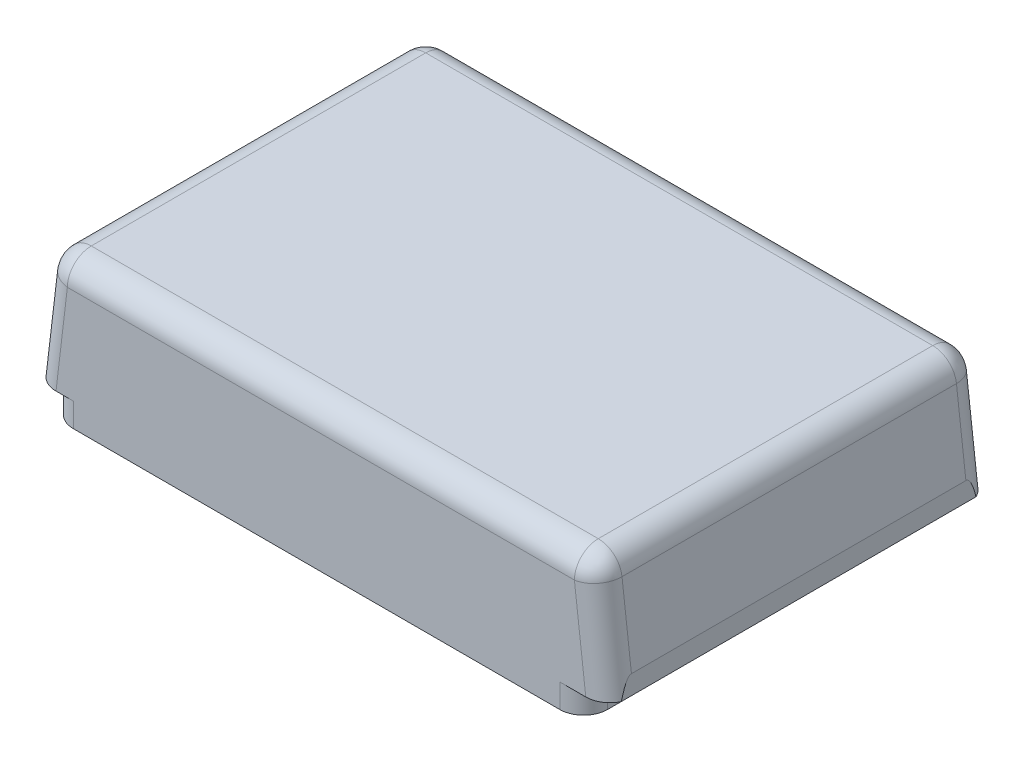
ISO-10303-21;
HEADER;
FILE_DESCRIPTION(('STEP AP214'),'2;1');
FILE_NAME('part.step','',(''),(''),'','','');
FILE_SCHEMA(('AUTOMOTIVE_DESIGN { 1 0 10303 214 1 1 1 1 }'));
ENDSEC;
DATA;
#1=APPLICATION_CONTEXT('core data for automotive mechanical design processes');
#2=APPLICATION_PROTOCOL_DEFINITION('international standard','automotive_design',2000,#1);
#3=PRODUCT_CONTEXT('',#1,'mechanical');
#4=PRODUCT('Part','Part','',(#3));
#5=PRODUCT_RELATED_PRODUCT_CATEGORY('part','',(#4));
#6=PRODUCT_DEFINITION_FORMATION('','',#4);
#7=PRODUCT_DEFINITION_CONTEXT('part definition',#1,'design');
#8=PRODUCT_DEFINITION('design','',#6,#7);
#9=PRODUCT_DEFINITION_SHAPE('','',#8);
#10=(LENGTH_UNIT() NAMED_UNIT(*) SI_UNIT(.MILLI.,.METRE.));
#11=(NAMED_UNIT(*) PLANE_ANGLE_UNIT() SI_UNIT($,.RADIAN.));
#12=(NAMED_UNIT(*) SI_UNIT($,.STERADIAN.) SOLID_ANGLE_UNIT());
#13=UNCERTAINTY_MEASURE_WITH_UNIT(LENGTH_MEASURE(1.E-05),#10,'distance_accuracy_value','');
#14=(GEOMETRIC_REPRESENTATION_CONTEXT(3) GLOBAL_UNCERTAINTY_ASSIGNED_CONTEXT((#13)) GLOBAL_UNIT_ASSIGNED_CONTEXT((#10,
#11,#12)) REPRESENTATION_CONTEXT('',''));
#15=CARTESIAN_POINT('',(0.,0.,0.));
#16=DIRECTION('',(0.,0.,1.));
#17=DIRECTION('',(1.,0.,0.));
#18=AXIS2_PLACEMENT_3D('',#15,#16,#17);
#19=CARTESIAN_POINT('',(-120.,0.,160.));
#20=DIRECTION('',(1.,0.,0.));
#21=DIRECTION('',(0.,0.,-1.));
#22=AXIS2_PLACEMENT_3D('',#19,#20,#21);
#23=PLANE('',#22);
#24=DIRECTION('',(0.,0.,-1.));
#25=VECTOR('',#24,1.);
#26=CARTESIAN_POINT('',(-120.,-8.,160.));
#27=LINE('',#26,#25);
#28=CARTESIAN_POINT('',(-120.,-8.,154.244962659163));
#29=VERTEX_POINT('',#28);
#30=CARTESIAN_POINT('',(-120.,-8.,5.7550373408366));
#31=VERTEX_POINT('',#30);
#32=EDGE_CURVE('E201',#29,#31,#27,.T.);
#33=ORIENTED_EDGE('',*,*,#32,.F.);
#34=CARTESIAN_POINT('',(-120.,-84.5931439302263,150.));
#35=DIRECTION('',(1.,0.,0.));
#36=DIRECTION('',(0.,1.,0.));
#37=AXIS2_PLACEMENT_3D('',#34,#35,#36);
#38=ELLIPSE('',#37,84.5931439302263,10.);
#39=CARTESIAN_POINT('',(-120.,0.,150.));
#40=VERTEX_POINT('',#39);
#41=EDGE_CURVE('E220',#29,#40,#38,.F.);
#42=ORIENTED_EDGE('',*,*,#41,.T.);
#43=DIRECTION('',(0.,0.,-1.));
#44=VECTOR('',#43,1.);
#45=CARTESIAN_POINT('',(-120.,0.,160.));
#46=LINE('',#45,#44);
#47=CARTESIAN_POINT('',(-120.,0.,10.));
#48=VERTEX_POINT('',#47);
#49=EDGE_CURVE('E184',#40,#48,#46,.T.);
#50=ORIENTED_EDGE('',*,*,#49,.T.);
#51=CARTESIAN_POINT('',(-120.,-84.5931439302263,10.));
#52=DIRECTION('',(1.,0.,0.));
#53=DIRECTION('',(0.,-1.,0.));
#54=AXIS2_PLACEMENT_3D('',#51,#52,#53);
#55=ELLIPSE('',#54,84.5931439302263,10.);
#56=EDGE_CURVE('E218',#48,#31,#55,.F.);
#57=ORIENTED_EDGE('',*,*,#56,.T.);
#58=EDGE_LOOP('',(#33,#42,#50,#57));
#59=FACE_BOUND('',#58,.T.);
#60=ADVANCED_FACE('F35',(#59),#23,.F.);
#61=CARTESIAN_POINT('',(-120.,-8.,160.));
#62=DIRECTION('',(0.,1.,0.));
#63=DIRECTION('',(0.,0.,1.));
#64=AXIS2_PLACEMENT_3D('',#61,#62,#63);
#65=PLANE('',#64);
#66=DIRECTION('',(0.,0.,-1.));
#67=VECTOR('',#66,1.);
#68=CARTESIAN_POINT('',(-113.647058823529,-8.,160.));
#69=LINE('',#68,#67);
#70=CARTESIAN_POINT('',(-113.647058823529,-8.,150.));
#71=VERTEX_POINT('',#70);
#72=CARTESIAN_POINT('',(-113.647058823529,-8.,10.));
#73=VERTEX_POINT('',#72);
#74=EDGE_CURVE('E207',#71,#73,#69,.T.);
#75=ORIENTED_EDGE('',*,*,#74,.F.);
#76=CARTESIAN_POINT('',(-103.647058823529,-8.,150.));
#77=DIRECTION('',(0.,1.,0.));
#78=DIRECTION('',(0.,0.,1.));
#79=AXIS2_PLACEMENT_3D('',#76,#77,#78);
#80=CIRCLE('',#79,10.);
#81=CARTESIAN_POINT('',(-103.647058823529,-8.,160.));
#82=VERTEX_POINT('',#81);
#83=EDGE_CURVE('E258',#71,#82,#80,.T.);
#84=ORIENTED_EDGE('',*,*,#83,.T.);
#85=DIRECTION('',(1.,0.,0.));
#86=VECTOR('',#85,1.);
#87=CARTESIAN_POINT('',(-120.,-8.,160.));
#88=LINE('',#87,#86);
#89=CARTESIAN_POINT('',(-110.881768579735,-8.,160.));
#90=VERTEX_POINT('',#89);
#91=EDGE_CURVE('E241',#90,#82,#88,.T.);
#92=ORIENTED_EDGE('',*,*,#91,.F.);
#93=CARTESIAN_POINT('',(-110.881768579735,-8.,150.));
#94=DIRECTION('',(0.,1.,0.));
#95=DIRECTION('',(1.,0.,0.));
#96=AXIS2_PLACEMENT_3D('',#93,#94,#95);
#97=ELLIPSE('',#96,10.070612372646,10.);
#98=EDGE_CURVE('E216',#90,#29,#97,.F.);
#99=ORIENTED_EDGE('',*,*,#98,.T.);
#100=ORIENTED_EDGE('',*,*,#32,.T.);
#101=CARTESIAN_POINT('',(-110.881768579735,-8.,10.));
#102=DIRECTION('',(0.,1.,0.));
#103=DIRECTION('',(-1.,0.,0.));
#104=AXIS2_PLACEMENT_3D('',#101,#102,#103);
#105=ELLIPSE('',#104,10.070612372646,10.);
#106=CARTESIAN_POINT('',(-110.881768579735,-8.,0.));
#107=VERTEX_POINT('',#106);
#108=EDGE_CURVE('E214',#31,#107,#105,.F.);
#109=ORIENTED_EDGE('',*,*,#108,.T.);
#110=DIRECTION('',(-1.,0.,0.));
#111=VECTOR('',#110,1.);
#112=CARTESIAN_POINT('',(0.,-8.,0.));
#113=LINE('',#112,#111);
#114=CARTESIAN_POINT('',(-103.647058823529,-8.,0.));
#115=VERTEX_POINT('',#114);
#116=EDGE_CURVE('E270',#115,#107,#113,.T.);
#117=ORIENTED_EDGE('',*,*,#116,.F.);
#118=CARTESIAN_POINT('',(-103.647058823529,-8.,10.));
#119=DIRECTION('',(0.,1.,0.));
#120=DIRECTION('',(0.,0.,1.));
#121=AXIS2_PLACEMENT_3D('',#118,#119,#120);
#122=CIRCLE('',#121,10.);
#123=EDGE_CURVE('E276',#115,#73,#122,.T.);
#124=ORIENTED_EDGE('',*,*,#123,.T.);
#125=EDGE_LOOP('',(#75,#84,#92,#99,#100,#109,#117,#124));
#126=FACE_BOUND('',#125,.T.);
#127=ADVANCED_FACE('F431',(#126),#65,.F.);
#128=CARTESIAN_POINT('',(-113.647058823529,-8.,160.));
#129=DIRECTION('',(1.,0.,0.));
#130=DIRECTION('',(0.,0.,-1.));
#131=AXIS2_PLACEMENT_3D('',#128,#129,#130);
#132=PLANE('',#131);
#133=ORIENTED_EDGE('',*,*,#74,.T.);
#134=DIRECTION('',(0.,-1.,0.));
#135=VECTOR('',#134,1.);
#136=CARTESIAN_POINT('',(-113.647058823529,-8.,10.));
#137=LINE('',#136,#135);
#138=CARTESIAN_POINT('',(-113.647058823529,-18.,10.));
#139=VERTEX_POINT('',#138);
#140=EDGE_CURVE('E265',#73,#139,#137,.T.);
#141=ORIENTED_EDGE('',*,*,#140,.T.);
#142=DIRECTION('',(0.,0.,-1.));
#143=VECTOR('',#142,1.);
#144=CARTESIAN_POINT('',(-113.647058823529,-18.,160.));
#145=LINE('',#144,#143);
#146=CARTESIAN_POINT('',(-113.647058823529,-18.,150.));
#147=VERTEX_POINT('',#146);
#148=EDGE_CURVE('E347',#147,#139,#145,.T.);
#149=ORIENTED_EDGE('',*,*,#148,.F.);
#150=DIRECTION('',(0.,1.,0.));
#151=VECTOR('',#150,1.);
#152=CARTESIAN_POINT('',(-113.647058823529,-8.,150.));
#153=LINE('',#152,#151);
#154=EDGE_CURVE('E233',#147,#71,#153,.T.);
#155=ORIENTED_EDGE('',*,*,#154,.T.);
#156=EDGE_LOOP('',(#133,#141,#149,#155));
#157=FACE_BOUND('',#156,.T.);
#158=ADVANCED_FACE('F353',(#157),#132,.F.);
#159=CARTESIAN_POINT('',(-113.647058823529,-18.,160.));
#160=DIRECTION('',(0.,1.,0.));
#161=DIRECTION('',(0.,0.,1.));
#162=AXIS2_PLACEMENT_3D('',#159,#160,#161);
#163=PLANE('',#162);
#164=ORIENTED_EDGE('',*,*,#148,.T.);
#165=CARTESIAN_POINT('',(-103.647058823529,-18.,10.));
#166=DIRECTION('',(0.,1.,0.));
#167=DIRECTION('',(0.,0.,1.));
#168=AXIS2_PLACEMENT_3D('',#165,#166,#167);
#169=CIRCLE('',#168,10.);
#170=CARTESIAN_POINT('',(-103.647058823529,-18.,0.));
#171=VERTEX_POINT('',#170);
#172=EDGE_CURVE('E268',#139,#171,#169,.F.);
#173=ORIENTED_EDGE('',*,*,#172,.T.);
#174=DIRECTION('',(1.,0.,0.));
#175=VECTOR('',#174,1.);
#176=CARTESIAN_POINT('',(-113.647058823529,-18.,0.));
#177=LINE('',#176,#175);
#178=CARTESIAN_POINT('',(100.,-18.,0.));
#179=VERTEX_POINT('',#178);
#180=EDGE_CURVE('E323',#171,#179,#177,.T.);
#181=ORIENTED_EDGE('',*,*,#180,.T.);
#182=CARTESIAN_POINT('',(100.,-18.,10.));
#183=DIRECTION('',(0.,1.,0.));
#184=DIRECTION('',(0.,0.,1.));
#185=AXIS2_PLACEMENT_3D('',#182,#183,#184);
#186=CIRCLE('',#185,10.);
#187=CARTESIAN_POINT('',(110.,-18.,10.));
#188=VERTEX_POINT('',#187);
#189=EDGE_CURVE('E246',#179,#188,#186,.F.);
#190=ORIENTED_EDGE('',*,*,#189,.T.);
#191=DIRECTION('',(0.,0.,-1.));
#192=VECTOR('',#191,1.);
#193=CARTESIAN_POINT('',(110.,-18.,160.));
#194=LINE('',#193,#192);
#195=CARTESIAN_POINT('',(110.,-18.,150.));
#196=VERTEX_POINT('',#195);
#197=EDGE_CURVE('E344',#196,#188,#194,.T.);
#198=ORIENTED_EDGE('',*,*,#197,.F.);
#199=CARTESIAN_POINT('',(100.,-18.,150.));
#200=DIRECTION('',(0.,1.,0.));
#201=DIRECTION('',(0.,0.,1.));
#202=AXIS2_PLACEMENT_3D('',#199,#200,#201);
#203=CIRCLE('',#202,10.);
#204=CARTESIAN_POINT('',(100.,-18.,160.));
#205=VERTEX_POINT('',#204);
#206=EDGE_CURVE('E244',#196,#205,#203,.F.);
#207=ORIENTED_EDGE('',*,*,#206,.T.);
#208=DIRECTION('',(1.,0.,0.));
#209=VECTOR('',#208,1.);
#210=CARTESIAN_POINT('',(-113.647058823529,-18.,160.));
#211=LINE('',#210,#209);
#212=CARTESIAN_POINT('',(-103.647058823529,-18.,160.));
#213=VERTEX_POINT('',#212);
#214=EDGE_CURVE('E332',#213,#205,#211,.T.);
#215=ORIENTED_EDGE('',*,*,#214,.F.);
#216=CARTESIAN_POINT('',(-103.647058823529,-18.,150.));
#217=DIRECTION('',(0.,1.,0.));
#218=DIRECTION('',(0.,0.,1.));
#219=AXIS2_PLACEMENT_3D('',#216,#217,#218);
#220=CIRCLE('',#219,10.);
#221=EDGE_CURVE('E248',#213,#147,#220,.F.);
#222=ORIENTED_EDGE('',*,*,#221,.T.);
#223=EDGE_LOOP('',(#164,#173,#181,#190,#198,#207,#215,#222));
#224=FACE_BOUND('',#223,.T.);
#225=ADVANCED_FACE('F361',(#224),#163,.F.);
#226=CARTESIAN_POINT('',(110.,-18.,160.));
#227=DIRECTION('',(-1.,0.,0.));
#228=DIRECTION('',(0.,0.,1.));
#229=AXIS2_PLACEMENT_3D('',#226,#227,#228);
#230=PLANE('',#229);
#231=ORIENTED_EDGE('',*,*,#197,.T.);
#232=DIRECTION('',(0.,1.,0.));
#233=VECTOR('',#232,1.);
#234=CARTESIAN_POINT('',(110.,-18.,10.));
#235=LINE('',#234,#233);
#236=CARTESIAN_POINT('',(110.,-8.,10.));
#237=VERTEX_POINT('',#236);
#238=EDGE_CURVE('E252',#188,#237,#235,.T.);
#239=ORIENTED_EDGE('',*,*,#238,.T.);
#240=DIRECTION('',(0.,0.,-1.));
#241=VECTOR('',#240,1.);
#242=CARTESIAN_POINT('',(110.,-8.,160.));
#243=LINE('',#242,#241);
#244=CARTESIAN_POINT('',(110.,-8.,150.));
#245=VERTEX_POINT('',#244);
#246=EDGE_CURVE('E341',#245,#237,#243,.T.);
#247=ORIENTED_EDGE('',*,*,#246,.F.);
#248=DIRECTION('',(0.,1.,0.));
#249=VECTOR('',#248,1.);
#250=CARTESIAN_POINT('',(110.,-18.,150.));
#251=LINE('',#250,#249);
#252=EDGE_CURVE('E250',#245,#196,#251,.F.);
#253=ORIENTED_EDGE('',*,*,#252,.T.);
#254=EDGE_LOOP('',(#231,#239,#247,#253));
#255=FACE_BOUND('',#254,.T.);
#256=ADVANCED_FACE('F372',(#255),#230,.F.);
#257=CARTESIAN_POINT('',(110.,-8.,160.));
#258=DIRECTION('',(0.,1.,0.));
#259=DIRECTION('',(0.,0.,1.));
#260=AXIS2_PLACEMENT_3D('',#257,#258,#259);
#261=PLANE('',#260);
#262=DIRECTION('',(0.,0.,-1.));
#263=VECTOR('',#262,1.);
#264=CARTESIAN_POINT('',(120.,-8.,160.));
#265=LINE('',#264,#263);
#266=CARTESIAN_POINT('',(120.,-8.,154.244962659163));
#267=VERTEX_POINT('',#266);
#268=CARTESIAN_POINT('',(120.,-8.,5.7550373408366));
#269=VERTEX_POINT('',#268);
#270=EDGE_CURVE('E183',#267,#269,#265,.T.);
#271=ORIENTED_EDGE('',*,*,#270,.F.);
#272=CARTESIAN_POINT('',(110.881768579735,-8.,150.));
#273=DIRECTION('',(0.,1.,0.));
#274=DIRECTION('',(1.,0.,0.));
#275=AXIS2_PLACEMENT_3D('',#272,#273,#274);
#276=ELLIPSE('',#275,10.070612372646,10.);
#277=CARTESIAN_POINT('',(110.881768579735,-8.,160.));
#278=VERTEX_POINT('',#277);
#279=EDGE_CURVE('E231',#267,#278,#276,.F.);
#280=ORIENTED_EDGE('',*,*,#279,.T.);
#281=DIRECTION('',(1.,0.,0.));
#282=VECTOR('',#281,1.);
#283=CARTESIAN_POINT('',(110.,-8.,160.));
#284=LINE('',#283,#282);
#285=CARTESIAN_POINT('',(100.,-8.,160.));
#286=VERTEX_POINT('',#285);
#287=EDGE_CURVE('E335',#286,#278,#284,.T.);
#288=ORIENTED_EDGE('',*,*,#287,.F.);
#289=CARTESIAN_POINT('',(100.,-8.,150.));
#290=DIRECTION('',(0.,1.,0.));
#291=DIRECTION('',(0.,0.,1.));
#292=AXIS2_PLACEMENT_3D('',#289,#290,#291);
#293=CIRCLE('',#292,10.);
#294=EDGE_CURVE('E263',#286,#245,#293,.T.);
#295=ORIENTED_EDGE('',*,*,#294,.T.);
#296=ORIENTED_EDGE('',*,*,#246,.T.);
#297=CARTESIAN_POINT('',(100.,-8.,10.));
#298=DIRECTION('',(0.,1.,0.));
#299=DIRECTION('',(0.,0.,1.));
#300=AXIS2_PLACEMENT_3D('',#297,#298,#299);
#301=CIRCLE('',#300,10.);
#302=CARTESIAN_POINT('',(100.,-8.,0.));
#303=VERTEX_POINT('',#302);
#304=EDGE_CURVE('E260',#237,#303,#301,.T.);
#305=ORIENTED_EDGE('',*,*,#304,.T.);
#306=DIRECTION('',(1.,0.,0.));
#307=VECTOR('',#306,1.);
#308=CARTESIAN_POINT('',(110.,-8.,0.));
#309=LINE('',#308,#307);
#310=CARTESIAN_POINT('',(110.881768579735,-8.,0.));
#311=VERTEX_POINT('',#310);
#312=EDGE_CURVE('E327',#303,#311,#309,.T.);
#313=ORIENTED_EDGE('',*,*,#312,.T.);
#314=CARTESIAN_POINT('',(110.881768579735,-8.,10.));
#315=DIRECTION('',(0.,1.,0.));
#316=DIRECTION('',(-1.,0.,0.));
#317=AXIS2_PLACEMENT_3D('',#314,#315,#316);
#318=ELLIPSE('',#317,10.070612372646,10.);
#319=EDGE_CURVE('E194',#311,#269,#318,.F.);
#320=ORIENTED_EDGE('',*,*,#319,.T.);
#321=EDGE_LOOP('',(#271,#280,#288,#295,#296,#305,#313,#320));
#322=FACE_BOUND('',#321,.T.);
#323=ADVANCED_FACE('F421',(#322),#261,.F.);
#324=CARTESIAN_POINT('',(120.,-8.,160.));
#325=DIRECTION('',(-1.,0.,0.));
#326=DIRECTION('',(0.,0.,1.));
#327=AXIS2_PLACEMENT_3D('',#324,#325,#326);
#328=PLANE('',#327);
#329=DIRECTION('',(0.,0.,-1.));
#330=VECTOR('',#329,1.);
#331=CARTESIAN_POINT('',(120.,0.,160.));
#332=LINE('',#331,#330);
#333=CARTESIAN_POINT('',(120.,0.,150.));
#334=VERTEX_POINT('',#333);
#335=CARTESIAN_POINT('',(120.,0.,10.));
#336=VERTEX_POINT('',#335);
#337=EDGE_CURVE('E173',#334,#336,#332,.T.);
#338=ORIENTED_EDGE('',*,*,#337,.F.);
#339=CARTESIAN_POINT('',(120.,-84.5931439302267,150.));
#340=DIRECTION('',(-1.,0.,0.));
#341=DIRECTION('',(0.,-1.,0.));
#342=AXIS2_PLACEMENT_3D('',#339,#340,#341);
#343=ELLIPSE('',#342,84.5931439302268,10.);
#344=EDGE_CURVE('E229',#334,#267,#343,.F.);
#345=ORIENTED_EDGE('',*,*,#344,.T.);
#346=ORIENTED_EDGE('',*,*,#270,.T.);
#347=CARTESIAN_POINT('',(120.,-84.5931439302267,10.));
#348=DIRECTION('',(-1.,0.,0.));
#349=DIRECTION('',(0.,1.,0.));
#350=AXIS2_PLACEMENT_3D('',#347,#348,#349);
#351=ELLIPSE('',#350,84.5931439302268,10.);
#352=EDGE_CURVE('E187',#269,#336,#351,.F.);
#353=ORIENTED_EDGE('',*,*,#352,.T.);
#354=EDGE_LOOP('',(#338,#345,#346,#353));
#355=FACE_BOUND('',#354,.T.);
#356=ADVANCED_FACE('F188',(#355),#328,.F.);
#357=CARTESIAN_POINT('',(120.,0.,160.));
#358=DIRECTION('',(-0.992988274194944,-0.118212889785112,0.));
#359=DIRECTION('',(0.118212889785112,-0.992988274194944,0.));
#360=AXIS2_PLACEMENT_3D('',#357,#358,#359);
#361=PLANE('',#360);
#362=DIRECTION('',(-0.118212889785112,0.992988274194944,0.));
#363=VECTOR('',#362,1.);
#364=CARTESIAN_POINT('',(120.,0.,10.));
#365=LINE('',#364,#363);
#366=CARTESIAN_POINT('',(116.04974655978,33.1821288978511,10.));
#367=VERTEX_POINT('',#366);
#368=EDGE_CURVE('E177',#336,#367,#365,.T.);
#369=ORIENTED_EDGE('',*,*,#368,.T.);
#370=DIRECTION('',(0.,0.,-1.));
#371=VECTOR('',#370,1.);
#372=CARTESIAN_POINT('',(116.04974655978,33.1821288978511,160.));
#373=LINE('',#372,#371);
#374=CARTESIAN_POINT('',(116.04974655978,33.1821288978511,150.));
#375=VERTEX_POINT('',#374);
#376=EDGE_CURVE('E290',#367,#375,#373,.F.);
#377=ORIENTED_EDGE('',*,*,#376,.T.);
#378=DIRECTION('',(-0.118212889785112,0.992988274194944,0.));
#379=VECTOR('',#378,1.);
#380=CARTESIAN_POINT('',(120.,0.,150.));
#381=LINE('',#380,#379);
#382=EDGE_CURVE('E180',#375,#334,#381,.F.);
#383=ORIENTED_EDGE('',*,*,#382,.T.);
#384=ORIENTED_EDGE('',*,*,#337,.T.);
#385=EDGE_LOOP('',(#369,#377,#383,#384));
#386=FACE_BOUND('',#385,.T.);
#387=ADVANCED_FACE('F175',(#386),#361,.F.);
#388=CARTESIAN_POINT('',(115.,42.,160.));
#389=DIRECTION('',(0.,-1.,0.));
#390=DIRECTION('',(1.,0.,0.));
#391=AXIS2_PLACEMENT_3D('',#388,#389,#390);
#392=PLANE('',#391);
#393=DIRECTION('',(-1.,0.,0.));
#394=VECTOR('',#393,1.);
#395=CARTESIAN_POINT('',(104.929387627354,42.,150.));
#396=LINE('',#395,#394);
#397=CARTESIAN_POINT('',(-106.11986381783,42.,150.));
#398=VERTEX_POINT('',#397);
#399=CARTESIAN_POINT('',(106.11986381783,42.,150.));
#400=VERTEX_POINT('',#399);
#401=EDGE_CURVE('E281',#398,#400,#396,.F.);
#402=ORIENTED_EDGE('',*,*,#401,.T.);
#403=DIRECTION('',(0.,0.,-1.));
#404=VECTOR('',#403,1.);
#405=CARTESIAN_POINT('',(106.11986381783,42.,160.));
#406=LINE('',#405,#404);
#407=CARTESIAN_POINT('',(106.11986381783,42.,10.));
#408=VERTEX_POINT('',#407);
#409=EDGE_CURVE('E287',#400,#408,#406,.T.);
#410=ORIENTED_EDGE('',*,*,#409,.T.);
#411=DIRECTION('',(-1.,0.,0.));
#412=VECTOR('',#411,1.);
#413=CARTESIAN_POINT('',(115.,42.,10.));
#414=LINE('',#413,#412);
#415=CARTESIAN_POINT('',(-106.11986381783,42.,10.));
#416=VERTEX_POINT('',#415);
#417=EDGE_CURVE('E285',#408,#416,#414,.T.);
#418=ORIENTED_EDGE('',*,*,#417,.T.);
#419=DIRECTION('',(0.,0.,-1.));
#420=VECTOR('',#419,1.);
#421=CARTESIAN_POINT('',(-106.11986381783,42.,160.));
#422=LINE('',#421,#420);
#423=EDGE_CURVE('E283',#416,#398,#422,.F.);
#424=ORIENTED_EDGE('',*,*,#423,.T.);
#425=EDGE_LOOP('',(#402,#410,#418,#424));
#426=FACE_BOUND('',#425,.T.);
#427=ADVANCED_FACE('F532',(#426),#392,.F.);
#428=CARTESIAN_POINT('',(-115.,42.,160.));
#429=DIRECTION('',(0.992988274194944,-0.118212889785113,0.));
#430=DIRECTION('',(0.118212889785113,0.992988274194944,0.));
#431=AXIS2_PLACEMENT_3D('',#428,#429,#430);
#432=PLANE('',#431);
#433=DIRECTION('',(-0.118212889785113,-0.992988274194944,0.));
#434=VECTOR('',#433,1.);
#435=CARTESIAN_POINT('',(-115.,42.,150.));
#436=LINE('',#435,#434);
#437=CARTESIAN_POINT('',(-116.04974655978,33.1821288978511,150.));
#438=VERTEX_POINT('',#437);
#439=EDGE_CURVE('E224',#40,#438,#436,.F.);
#440=ORIENTED_EDGE('',*,*,#439,.T.);
#441=DIRECTION('',(0.,0.,-1.));
#442=VECTOR('',#441,1.);
#443=CARTESIAN_POINT('',(-116.04974655978,33.1821288978511,160.));
#444=LINE('',#443,#442);
#445=CARTESIAN_POINT('',(-116.04974655978,33.1821288978511,10.));
#446=VERTEX_POINT('',#445);
#447=EDGE_CURVE('E297',#438,#446,#444,.T.);
#448=ORIENTED_EDGE('',*,*,#447,.T.);
#449=DIRECTION('',(-0.118212889785113,-0.992988274194944,0.));
#450=VECTOR('',#449,1.);
#451=CARTESIAN_POINT('',(-115.,42.,10.));
#452=LINE('',#451,#450);
#453=EDGE_CURVE('E222',#446,#48,#452,.T.);
#454=ORIENTED_EDGE('',*,*,#453,.T.);
#455=ORIENTED_EDGE('',*,*,#49,.F.);
#456=EDGE_LOOP('',(#440,#448,#454,#455));
#457=FACE_BOUND('',#456,.T.);
#458=ADVANCED_FACE('F410',(#457),#432,.F.);
#459=CARTESIAN_POINT('',(0.,0.,160.));
#460=DIRECTION('',(0.,0.,1.));
#461=DIRECTION('',(1.,0.,0.));
#462=AXIS2_PLACEMENT_3D('',#459,#460,#461);
#463=PLANE('',#462);
#464=DIRECTION('',(-0.118212889785112,0.992988274194944,0.));
#465=VECTOR('',#464,1.);
#466=CARTESIAN_POINT('',(105.070117258051,40.8178711021489,160.));
#467=LINE('',#466,#465);
#468=CARTESIAN_POINT('',(106.11986381783,32.,160.));
#469=VERTEX_POINT('',#468);
#470=EDGE_CURVE('E226',#278,#469,#467,.T.);
#471=ORIENTED_EDGE('',*,*,#470,.T.);
#472=DIRECTION('',(-1.,0.,0.));
#473=VECTOR('',#472,1.);
#474=CARTESIAN_POINT('',(-104.929387627354,32.,160.));
#475=LINE('',#474,#473);
#476=CARTESIAN_POINT('',(-106.11986381783,32.,160.));
#477=VERTEX_POINT('',#476);
#478=EDGE_CURVE('E11',#469,#477,#475,.T.);
#479=ORIENTED_EDGE('',*,*,#478,.T.);
#480=DIRECTION('',(-0.118212889785113,-0.992988274194944,0.));
#481=VECTOR('',#480,1.);
#482=CARTESIAN_POINT('',(-110.070117258051,-1.18212889785113,160.));
#483=LINE('',#482,#481);
#484=EDGE_CURVE('E193',#477,#90,#483,.T.);
#485=ORIENTED_EDGE('',*,*,#484,.T.);
#486=ORIENTED_EDGE('',*,*,#91,.T.);
#487=DIRECTION('',(0.,1.,0.));
#488=VECTOR('',#487,1.);
#489=CARTESIAN_POINT('',(-103.647058823529,-8.,160.));
#490=LINE('',#489,#488);
#491=EDGE_CURVE('E239',#82,#213,#490,.F.);
#492=ORIENTED_EDGE('',*,*,#491,.T.);
#493=ORIENTED_EDGE('',*,*,#214,.T.);
#494=DIRECTION('',(0.,1.,0.));
#495=VECTOR('',#494,1.);
#496=CARTESIAN_POINT('',(100.,-8.,160.));
#497=LINE('',#496,#495);
#498=EDGE_CURVE('E236',#205,#286,#497,.T.);
#499=ORIENTED_EDGE('',*,*,#498,.T.);
#500=ORIENTED_EDGE('',*,*,#287,.T.);
#501=EDGE_LOOP('',(#471,#479,#485,#486,#492,#493,#499,#500));
#502=FACE_BOUND('',#501,.T.);
#503=ADVANCED_FACE('F382',(#502),#463,.T.);
#504=CARTESIAN_POINT('',(0.,0.,0.));
#505=DIRECTION('',(0.,0.,1.));
#506=DIRECTION('',(1.,0.,0.));
#507=AXIS2_PLACEMENT_3D('',#504,#505,#506);
#508=PLANE('',#507);
#509=DIRECTION('',(-0.118212889785113,-0.992988274194944,0.));
#510=VECTOR('',#509,1.);
#511=CARTESIAN_POINT('',(-108.393202780689,12.9039527119868,0.));
#512=LINE('',#511,#510);
#513=CARTESIAN_POINT('',(-106.11986381783,32.,0.));
#514=VERTEX_POINT('',#513);
#515=EDGE_CURVE('E200',#107,#514,#512,.F.);
#516=ORIENTED_EDGE('',*,*,#515,.T.);
#517=DIRECTION('',(-1.,0.,0.));
#518=VECTOR('',#517,1.);
#519=CARTESIAN_POINT('',(0.,32.,0.));
#520=LINE('',#519,#518);
#521=CARTESIAN_POINT('',(106.11986381783,32.,0.));
#522=VERTEX_POINT('',#521);
#523=EDGE_CURVE('E293',#514,#522,#520,.F.);
#524=ORIENTED_EDGE('',*,*,#523,.T.);
#525=DIRECTION('',(-0.118212889785112,0.992988274194944,0.));
#526=VECTOR('',#525,1.);
#527=CARTESIAN_POINT('',(108.393202780689,12.9039527119867,0.));
#528=LINE('',#527,#526);
#529=EDGE_CURVE('E204',#522,#311,#528,.F.);
#530=ORIENTED_EDGE('',*,*,#529,.T.);
#531=ORIENTED_EDGE('',*,*,#312,.F.);
#532=DIRECTION('',(0.,1.,0.));
#533=VECTOR('',#532,1.);
#534=CARTESIAN_POINT('',(100.,0.,0.));
#535=LINE('',#534,#533);
#536=EDGE_CURVE('E255',#303,#179,#535,.F.);
#537=ORIENTED_EDGE('',*,*,#536,.T.);
#538=ORIENTED_EDGE('',*,*,#180,.F.);
#539=DIRECTION('',(0.,-1.,0.));
#540=VECTOR('',#539,1.);
#541=CARTESIAN_POINT('',(-103.647058823529,0.,0.));
#542=LINE('',#541,#540);
#543=EDGE_CURVE('E273',#171,#115,#542,.F.);
#544=ORIENTED_EDGE('',*,*,#543,.T.);
#545=ORIENTED_EDGE('',*,*,#116,.T.);
#546=EDGE_LOOP('',(#516,#524,#530,#531,#537,#538,#544,#545));
#547=FACE_BOUND('',#546,.T.);
#548=ADVANCED_FACE('F363',(#547),#508,.F.);
#549=CARTESIAN_POINT('',(110.070117258051,-1.18212889785112,10.));
#550=DIRECTION('',(-0.118212889785112,0.992988274194944,0.));
#551=DIRECTION('',(-0.992988274194944,-0.118212889785112,0.));
#552=AXIS2_PLACEMENT_3D('',#549,#550,#551);
#553=CYLINDRICAL_SURFACE('',#552,10.);
#554=ORIENTED_EDGE('',*,*,#529,.F.);
#555=CARTESIAN_POINT('',(106.11986381783,32.,10.));
#556=DIRECTION('',(-0.118212889785112,0.992988274194944,0.));
#557=DIRECTION('',(-0.992988274194944,-0.118212889785112,0.));
#558=AXIS2_PLACEMENT_3D('',#555,#556,#557);
#559=CIRCLE('',#558,10.);
#560=EDGE_CURVE('E199',#522,#367,#559,.F.);
#561=ORIENTED_EDGE('',*,*,#560,.T.);
#562=ORIENTED_EDGE('',*,*,#368,.F.);
#563=ORIENTED_EDGE('',*,*,#352,.F.);
#564=ORIENTED_EDGE('',*,*,#319,.F.);
#565=EDGE_LOOP('',(#554,#561,#562,#563,#564));
#566=FACE_BOUND('',#565,.T.);
#567=ADVANCED_FACE('F197',(#566),#553,.T.);
#568=CARTESIAN_POINT('',(-108.393202780689,12.9039527119868,150.));
#569=DIRECTION('',(0.118212889785113,0.992988274194944,0.));
#570=DIRECTION('',(-0.992988274194944,0.118212889785113,0.));
#571=AXIS2_PLACEMENT_3D('',#568,#569,#570);
#572=CYLINDRICAL_SURFACE('',#571,10.);
#573=ORIENTED_EDGE('',*,*,#484,.F.);
#574=CARTESIAN_POINT('',(-106.11986381783,32.,150.));
#575=DIRECTION('',(0.118212889785113,0.992988274194944,0.));
#576=DIRECTION('',(-0.992988274194944,0.118212889785113,0.));
#577=AXIS2_PLACEMENT_3D('',#574,#575,#576);
#578=CIRCLE('',#577,10.);
#579=EDGE_CURVE('E44',#477,#438,#578,.F.);
#580=ORIENTED_EDGE('',*,*,#579,.T.);
#581=ORIENTED_EDGE('',*,*,#439,.F.);
#582=ORIENTED_EDGE('',*,*,#41,.F.);
#583=ORIENTED_EDGE('',*,*,#98,.F.);
#584=EDGE_LOOP('',(#573,#580,#581,#582,#583));
#585=FACE_BOUND('',#584,.T.);
#586=ADVANCED_FACE('F443',(#585),#572,.T.);
#587=CARTESIAN_POINT('',(-105.070117258051,40.8178711021489,10.));
#588=DIRECTION('',(-0.118212889785113,-0.992988274194944,0.));
#589=DIRECTION('',(0.992988274194944,-0.118212889785113,0.));
#590=AXIS2_PLACEMENT_3D('',#587,#588,#589);
#591=CYLINDRICAL_SURFACE('',#590,10.);
#592=ORIENTED_EDGE('',*,*,#453,.F.);
#593=CARTESIAN_POINT('',(-106.11986381783,32.,10.));
#594=DIRECTION('',(-0.118212889785113,-0.992988274194944,0.));
#595=DIRECTION('',(0.992988274194944,-0.118212889785113,0.));
#596=AXIS2_PLACEMENT_3D('',#593,#594,#595);
#597=CIRCLE('',#596,10.);
#598=EDGE_CURVE('E295',#446,#514,#597,.T.);
#599=ORIENTED_EDGE('',*,*,#598,.T.);
#600=ORIENTED_EDGE('',*,*,#515,.F.);
#601=ORIENTED_EDGE('',*,*,#108,.F.);
#602=ORIENTED_EDGE('',*,*,#56,.F.);
#603=EDGE_LOOP('',(#592,#599,#600,#601,#602));
#604=FACE_BOUND('',#603,.T.);
#605=ADVANCED_FACE('F415',(#604),#591,.T.);
#606=CARTESIAN_POINT('',(108.393202780689,12.9039527119867,150.));
#607=DIRECTION('',(0.118212889785112,-0.992988274194944,0.));
#608=DIRECTION('',(0.992988274194944,0.118212889785112,0.));
#609=AXIS2_PLACEMENT_3D('',#606,#607,#608);
#610=CYLINDRICAL_SURFACE('',#609,10.);
#611=ORIENTED_EDGE('',*,*,#382,.F.);
#612=CARTESIAN_POINT('',(106.11986381783,32.,150.));
#613=DIRECTION('',(0.118212889785112,-0.992988274194944,0.));
#614=DIRECTION('',(0.992988274194944,0.118212889785112,0.));
#615=AXIS2_PLACEMENT_3D('',#612,#613,#614);
#616=CIRCLE('',#615,10.);
#617=EDGE_CURVE('E278',#375,#469,#616,.T.);
#618=ORIENTED_EDGE('',*,*,#617,.T.);
#619=ORIENTED_EDGE('',*,*,#470,.F.);
#620=ORIENTED_EDGE('',*,*,#279,.F.);
#621=ORIENTED_EDGE('',*,*,#344,.F.);
#622=EDGE_LOOP('',(#611,#618,#619,#620,#621));
#623=FACE_BOUND('',#622,.T.);
#624=ADVANCED_FACE('F389',(#623),#610,.T.);
#625=CARTESIAN_POINT('',(-103.647058823529,-8.,150.));
#626=DIRECTION('',(0.,-1.,0.));
#627=DIRECTION('',(0.,0.,-1.));
#628=AXIS2_PLACEMENT_3D('',#625,#626,#627);
#629=CYLINDRICAL_SURFACE('',#628,10.);
#630=ORIENTED_EDGE('',*,*,#221,.F.);
#631=ORIENTED_EDGE('',*,*,#491,.F.);
#632=ORIENTED_EDGE('',*,*,#83,.F.);
#633=ORIENTED_EDGE('',*,*,#154,.F.);
#634=EDGE_LOOP('',(#630,#631,#632,#633));
#635=FACE_BOUND('',#634,.T.);
#636=ADVANCED_FACE('F450',(#635),#629,.T.);
#637=CARTESIAN_POINT('',(100.,-18.,10.));
#638=DIRECTION('',(0.,1.,0.));
#639=DIRECTION('',(0.,0.,1.));
#640=AXIS2_PLACEMENT_3D('',#637,#638,#639);
#641=CYLINDRICAL_SURFACE('',#640,10.);
#642=ORIENTED_EDGE('',*,*,#189,.F.);
#643=ORIENTED_EDGE('',*,*,#536,.F.);
#644=ORIENTED_EDGE('',*,*,#304,.F.);
#645=ORIENTED_EDGE('',*,*,#238,.F.);
#646=EDGE_LOOP('',(#642,#643,#644,#645));
#647=FACE_BOUND('',#646,.T.);
#648=ADVANCED_FACE('F368',(#647),#641,.T.);
#649=CARTESIAN_POINT('',(100.,0.,150.));
#650=DIRECTION('',(0.,-1.,0.));
#651=DIRECTION('',(0.,0.,-1.));
#652=AXIS2_PLACEMENT_3D('',#649,#650,#651);
#653=CYLINDRICAL_SURFACE('',#652,10.);
#654=ORIENTED_EDGE('',*,*,#206,.F.);
#655=ORIENTED_EDGE('',*,*,#252,.F.);
#656=ORIENTED_EDGE('',*,*,#294,.F.);
#657=ORIENTED_EDGE('',*,*,#498,.F.);
#658=EDGE_LOOP('',(#654,#655,#656,#657));
#659=FACE_BOUND('',#658,.T.);
#660=ADVANCED_FACE('F377',(#659),#653,.T.);
#661=CARTESIAN_POINT('',(-103.647058823529,-8.,10.));
#662=DIRECTION('',(0.,-1.,0.));
#663=DIRECTION('',(0.,0.,-1.));
#664=AXIS2_PLACEMENT_3D('',#661,#662,#663);
#665=CYLINDRICAL_SURFACE('',#664,10.);
#666=ORIENTED_EDGE('',*,*,#123,.F.);
#667=ORIENTED_EDGE('',*,*,#543,.F.);
#668=ORIENTED_EDGE('',*,*,#172,.F.);
#669=ORIENTED_EDGE('',*,*,#140,.F.);
#670=EDGE_LOOP('',(#666,#667,#668,#669));
#671=FACE_BOUND('',#670,.T.);
#672=ADVANCED_FACE('F359',(#671),#665,.T.);
#673=CARTESIAN_POINT('',(-106.11986381783,32.,10.));
#674=DIRECTION('',(0.,-1.,0.));
#675=DIRECTION('',(1.,0.,0.));
#676=AXIS2_PLACEMENT_3D('',#673,#674,#675);
#677=SPHERICAL_SURFACE('',#676,10.);
#678=CARTESIAN_POINT('',(-106.11986381783,32.,10.));
#679=DIRECTION('',(1.,0.,0.));
#680=DIRECTION('',(0.,0.,-1.));
#681=AXIS2_PLACEMENT_3D('',#678,#679,#680);
#682=CIRCLE('',#681,10.);
#683=EDGE_CURVE('E315',#514,#416,#682,.T.);
#684=ORIENTED_EDGE('',*,*,#683,.F.);
#685=ORIENTED_EDGE('',*,*,#598,.F.);
#686=CARTESIAN_POINT('',(-106.11986381783,32.,10.));
#687=DIRECTION('',(0.,0.,1.));
#688=DIRECTION('',(1.,0.,0.));
#689=AXIS2_PLACEMENT_3D('',#686,#687,#688);
#690=CIRCLE('',#689,10.);
#691=EDGE_CURVE('E39',#416,#446,#690,.T.);
#692=ORIENTED_EDGE('',*,*,#691,.F.);
#693=EDGE_LOOP('',(#684,#685,#692));
#694=FACE_BOUND('',#693,.T.);
#695=ADVANCED_FACE('F37',(#694),#677,.T.);
#696=CARTESIAN_POINT('',(-106.11986381783,32.,160.));
#697=DIRECTION('',(0.,0.,-1.));
#698=DIRECTION('',(-1.,0.,0.));
#699=AXIS2_PLACEMENT_3D('',#696,#697,#698);
#700=CYLINDRICAL_SURFACE('',#699,10.);
#701=ORIENTED_EDGE('',*,*,#691,.T.);
#702=ORIENTED_EDGE('',*,*,#447,.F.);
#703=CARTESIAN_POINT('',(-106.11986381783,32.,150.));
#704=DIRECTION('',(0.,0.,1.));
#705=DIRECTION('',(1.,0.,0.));
#706=AXIS2_PLACEMENT_3D('',#703,#704,#705);
#707=CIRCLE('',#706,10.);
#708=EDGE_CURVE('E313',#398,#438,#707,.T.);
#709=ORIENTED_EDGE('',*,*,#708,.F.);
#710=ORIENTED_EDGE('',*,*,#423,.F.);
#711=EDGE_LOOP('',(#701,#702,#709,#710));
#712=FACE_BOUND('',#711,.T.);
#713=ADVANCED_FACE('F407',(#712),#700,.T.);
#714=CARTESIAN_POINT('',(115.,32.,10.));
#715=DIRECTION('',(-1.,0.,0.));
#716=DIRECTION('',(0.,-1.,0.));
#717=AXIS2_PLACEMENT_3D('',#714,#715,#716);
#718=CYLINDRICAL_SURFACE('',#717,10.);
#719=ORIENTED_EDGE('',*,*,#683,.T.);
#720=ORIENTED_EDGE('',*,*,#417,.F.);
#721=CARTESIAN_POINT('',(106.11986381783,32.,10.));
#722=DIRECTION('',(1.,0.,0.));
#723=DIRECTION('',(0.,0.,-1.));
#724=AXIS2_PLACEMENT_3D('',#721,#722,#723);
#725=CIRCLE('',#724,10.);
#726=EDGE_CURVE('E310',#522,#408,#725,.T.);
#727=ORIENTED_EDGE('',*,*,#726,.F.);
#728=ORIENTED_EDGE('',*,*,#523,.F.);
#729=EDGE_LOOP('',(#719,#720,#727,#728));
#730=FACE_BOUND('',#729,.T.);
#731=ADVANCED_FACE('F420',(#730),#718,.T.);
#732=CARTESIAN_POINT('',(-106.11986381783,32.,150.));
#733=DIRECTION('',(0.,-1.,0.));
#734=DIRECTION('',(1.,0.,0.));
#735=AXIS2_PLACEMENT_3D('',#732,#733,#734);
#736=SPHERICAL_SURFACE('',#735,10.);
#737=ORIENTED_EDGE('',*,*,#708,.T.);
#738=ORIENTED_EDGE('',*,*,#579,.F.);
#739=CARTESIAN_POINT('',(-106.11986381783,32.,150.));
#740=DIRECTION('',(1.,0.,0.));
#741=DIRECTION('',(0.,0.,-1.));
#742=AXIS2_PLACEMENT_3D('',#739,#740,#741);
#743=CIRCLE('',#742,10.);
#744=EDGE_CURVE('E307',#398,#477,#743,.T.);
#745=ORIENTED_EDGE('',*,*,#744,.F.);
#746=EDGE_LOOP('',(#737,#738,#745));
#747=FACE_BOUND('',#746,.T.);
#748=ADVANCED_FACE('F405',(#747),#736,.T.);
#749=CARTESIAN_POINT('',(106.11986381783,32.,10.));
#750=DIRECTION('',(0.,-1.,0.));
#751=DIRECTION('',(1.,0.,0.));
#752=AXIS2_PLACEMENT_3D('',#749,#750,#751);
#753=SPHERICAL_SURFACE('',#752,10.);
#754=ORIENTED_EDGE('',*,*,#560,.F.);
#755=ORIENTED_EDGE('',*,*,#726,.T.);
#756=CARTESIAN_POINT('',(106.11986381783,32.,10.));
#757=DIRECTION('',(0.,0.,1.));
#758=DIRECTION('',(1.,0.,0.));
#759=AXIS2_PLACEMENT_3D('',#756,#757,#758);
#760=CIRCLE('',#759,10.);
#761=EDGE_CURVE('E305',#367,#408,#760,.T.);
#762=ORIENTED_EDGE('',*,*,#761,.F.);
#763=EDGE_LOOP('',(#754,#755,#762));
#764=FACE_BOUND('',#763,.T.);
#765=ADVANCED_FACE('F466',(#764),#753,.T.);
#766=CARTESIAN_POINT('',(0.,32.,150.));
#767=DIRECTION('',(1.,0.,0.));
#768=DIRECTION('',(0.,1.,0.));
#769=AXIS2_PLACEMENT_3D('',#766,#767,#768);
#770=CYLINDRICAL_SURFACE('',#769,10.);
#771=ORIENTED_EDGE('',*,*,#744,.T.);
#772=ORIENTED_EDGE('',*,*,#478,.F.);
#773=CARTESIAN_POINT('',(106.11986381783,32.,150.));
#774=DIRECTION('',(1.,0.,0.));
#775=DIRECTION('',(0.,0.,-1.));
#776=AXIS2_PLACEMENT_3D('',#773,#774,#775);
#777=CIRCLE('',#776,10.);
#778=EDGE_CURVE('E303',#400,#469,#777,.T.);
#779=ORIENTED_EDGE('',*,*,#778,.F.);
#780=ORIENTED_EDGE('',*,*,#401,.F.);
#781=EDGE_LOOP('',(#771,#772,#779,#780));
#782=FACE_BOUND('',#781,.T.);
#783=ADVANCED_FACE('F402',(#782),#770,.T.);
#784=CARTESIAN_POINT('',(106.11986381783,32.,160.));
#785=DIRECTION('',(0.,0.,-1.));
#786=DIRECTION('',(-1.,0.,0.));
#787=AXIS2_PLACEMENT_3D('',#784,#785,#786);
#788=CYLINDRICAL_SURFACE('',#787,10.);
#789=ORIENTED_EDGE('',*,*,#761,.T.);
#790=ORIENTED_EDGE('',*,*,#409,.F.);
#791=CARTESIAN_POINT('',(106.11986381783,32.,150.));
#792=DIRECTION('',(0.,0.,1.));
#793=DIRECTION('',(1.,0.,0.));
#794=AXIS2_PLACEMENT_3D('',#791,#792,#793);
#795=CIRCLE('',#794,10.);
#796=EDGE_CURVE('E300',#375,#400,#795,.T.);
#797=ORIENTED_EDGE('',*,*,#796,.F.);
#798=ORIENTED_EDGE('',*,*,#376,.F.);
#799=EDGE_LOOP('',(#789,#790,#797,#798));
#800=FACE_BOUND('',#799,.T.);
#801=ADVANCED_FACE('F398',(#800),#788,.T.);
#802=CARTESIAN_POINT('',(106.11986381783,32.,150.));
#803=DIRECTION('',(0.,-1.,0.));
#804=DIRECTION('',(1.,0.,0.));
#805=AXIS2_PLACEMENT_3D('',#802,#803,#804);
#806=SPHERICAL_SURFACE('',#805,10.);
#807=ORIENTED_EDGE('',*,*,#778,.T.);
#808=ORIENTED_EDGE('',*,*,#617,.F.);
#809=ORIENTED_EDGE('',*,*,#796,.T.);
#810=EDGE_LOOP('',(#807,#808,#809));
#811=FACE_BOUND('',#810,.T.);
#812=ADVANCED_FACE('F393',(#811),#806,.T.);
#813=CLOSED_SHELL('',(#60,#127,#158,#225,#256,#323,#356,#387,#427,#458,#503,#548,#567,#586,#605,
#624,#636,#648,#660,#672,#695,#713,#731,#748,#765,#783,#801,#812));
#814=MANIFOLD_SOLID_BREP('B2',#813);
#815=ADVANCED_BREP_SHAPE_REPRESENTATION('',(#18,#814),#14);
#816=SHAPE_DEFINITION_REPRESENTATION(#9,#815);
ENDSEC;
END-ISO-10303-21;
